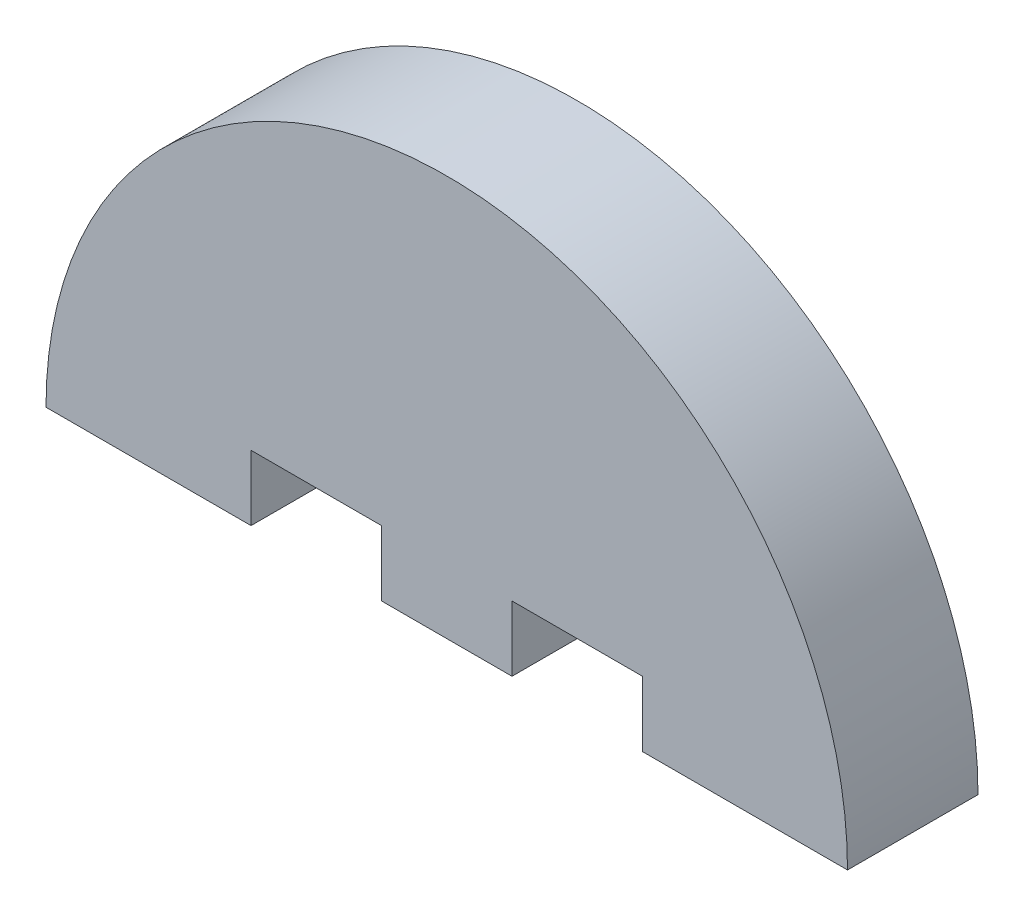
ISO-10303-21;
HEADER;
FILE_DESCRIPTION(('STEP AP214'),'2;1');
FILE_NAME('part.step','',(''),(''),'','','');
FILE_SCHEMA(('AUTOMOTIVE_DESIGN { 1 0 10303 214 1 1 1 1 }'));
ENDSEC;
DATA;
#1=APPLICATION_CONTEXT('core data for automotive mechanical design processes');
#2=APPLICATION_PROTOCOL_DEFINITION('international standard','automotive_design',2000,#1);
#3=PRODUCT_CONTEXT('',#1,'mechanical');
#4=PRODUCT('Part','Part','',(#3));
#5=PRODUCT_RELATED_PRODUCT_CATEGORY('part','',(#4));
#6=PRODUCT_DEFINITION_FORMATION('','',#4);
#7=PRODUCT_DEFINITION_CONTEXT('part definition',#1,'design');
#8=PRODUCT_DEFINITION('design','',#6,#7);
#9=PRODUCT_DEFINITION_SHAPE('','',#8);
#10=(LENGTH_UNIT() NAMED_UNIT(*) SI_UNIT(.MILLI.,.METRE.));
#11=(NAMED_UNIT(*) PLANE_ANGLE_UNIT() SI_UNIT($,.RADIAN.));
#12=(NAMED_UNIT(*) SI_UNIT($,.STERADIAN.) SOLID_ANGLE_UNIT());
#13=UNCERTAINTY_MEASURE_WITH_UNIT(LENGTH_MEASURE(1.E-05),#10,'distance_accuracy_value','');
#14=(GEOMETRIC_REPRESENTATION_CONTEXT(3) GLOBAL_UNCERTAINTY_ASSIGNED_CONTEXT((#13)) GLOBAL_UNIT_ASSIGNED_CONTEXT((#10,
#11,#12)) REPRESENTATION_CONTEXT('',''));
#15=CARTESIAN_POINT('',(0.,0.,0.));
#16=DIRECTION('',(0.,0.,1.));
#17=DIRECTION('',(1.,0.,0.));
#18=AXIS2_PLACEMENT_3D('',#15,#16,#17);
#19=CARTESIAN_POINT('',(3624.68304741668,1289.90302757437,6.));
#20=DIRECTION('',(0.,-1.,0.));
#21=DIRECTION('',(0.,0.,-1.));
#22=AXIS2_PLACEMENT_3D('',#19,#20,#21);
#23=PLANE('',#22);
#24=DIRECTION('',(-1.,0.,0.));
#25=VECTOR('',#24,1.);
#26=CARTESIAN_POINT('',(3624.68304741668,1289.90302757437,0.));
#27=LINE('',#26,#25);
#28=CARTESIAN_POINT('',(3624.68304741668,1289.90302757437,0.));
#29=VERTEX_POINT('',#28);
#30=CARTESIAN_POINT('',(3615.25447598811,1289.90302757437,0.));
#31=VERTEX_POINT('',#30);
#32=EDGE_CURVE('E154',#29,#31,#27,.T.);
#33=ORIENTED_EDGE('',*,*,#32,.F.);
#34=DIRECTION('',(0.,0.,-1.));
#35=VECTOR('',#34,1.);
#36=CARTESIAN_POINT('',(3624.68304741668,1289.90302757437,6.));
#37=LINE('',#36,#35);
#38=CARTESIAN_POINT('',(3624.68304741668,1289.90302757437,6.));
#39=VERTEX_POINT('',#38);
#40=EDGE_CURVE('E11',#39,#29,#37,.T.);
#41=ORIENTED_EDGE('',*,*,#40,.F.);
#42=DIRECTION('',(-1.,0.,0.));
#43=VECTOR('',#42,1.);
#44=CARTESIAN_POINT('',(3624.68304741668,1289.90302757437,6.));
#45=LINE('',#44,#43);
#46=CARTESIAN_POINT('',(3615.25447598811,1289.90302757437,6.));
#47=VERTEX_POINT('',#46);
#48=EDGE_CURVE('E188',#39,#47,#45,.T.);
#49=ORIENTED_EDGE('',*,*,#48,.T.);
#50=DIRECTION('',(0.,0.,-1.));
#51=VECTOR('',#50,1.);
#52=CARTESIAN_POINT('',(3615.25447598811,1289.90302757437,6.));
#53=LINE('',#52,#51);
#54=EDGE_CURVE('E42',#47,#31,#53,.T.);
#55=ORIENTED_EDGE('',*,*,#54,.T.);
#56=EDGE_LOOP('',(#33,#41,#49,#55));
#57=FACE_BOUND('',#56,.T.);
#58=ADVANCED_FACE('F39',(#57),#23,.T.);
#59=CARTESIAN_POINT('',(3606.25447598811,1289.90302757437,6.));
#60=DIRECTION('',(0.,0.,-1.));
#61=DIRECTION('',(-1.,0.,0.));
#62=AXIS2_PLACEMENT_3D('',#59,#60,#61);
#63=CYLINDRICAL_SURFACE('',#62,18.4285714285706);
#64=CARTESIAN_POINT('',(3606.25447598811,1289.90302757437,0.));
#65=DIRECTION('',(0.,0.,1.));
#66=DIRECTION('',(1.,0.,0.));
#67=AXIS2_PLACEMENT_3D('',#64,#65,#66);
#68=CIRCLE('',#67,18.4285714285706);
#69=CARTESIAN_POINT('',(3587.82590455954,1289.90302757437,0.));
#70=VERTEX_POINT('',#69);
#71=EDGE_CURVE('E186',#29,#70,#68,.T.);
#72=ORIENTED_EDGE('',*,*,#71,.T.);
#73=DIRECTION('',(0.,0.,-1.));
#74=VECTOR('',#73,1.);
#75=CARTESIAN_POINT('',(3587.82590455954,1289.90302757437,6.));
#76=LINE('',#75,#74);
#77=CARTESIAN_POINT('',(3587.82590455954,1289.90302757437,6.));
#78=VERTEX_POINT('',#77);
#79=EDGE_CURVE('E49',#78,#70,#76,.T.);
#80=ORIENTED_EDGE('',*,*,#79,.F.);
#81=CARTESIAN_POINT('',(3606.25447598811,1289.90302757437,6.));
#82=DIRECTION('',(0.,0.,1.));
#83=DIRECTION('',(1.,0.,0.));
#84=AXIS2_PLACEMENT_3D('',#81,#82,#83);
#85=CIRCLE('',#84,18.4285714285706);
#86=EDGE_CURVE('E139',#39,#78,#85,.T.);
#87=ORIENTED_EDGE('',*,*,#86,.F.);
#88=ORIENTED_EDGE('',*,*,#40,.T.);
#89=EDGE_LOOP('',(#72,#80,#87,#88));
#90=FACE_BOUND('',#89,.T.);
#91=ADVANCED_FACE('F215',(#90),#63,.T.);
#92=CARTESIAN_POINT('',(3597.25447598811,1289.90302757437,6.));
#93=DIRECTION('',(0.,-1.,0.));
#94=DIRECTION('',(0.,0.,-1.));
#95=AXIS2_PLACEMENT_3D('',#92,#93,#94);
#96=PLANE('',#95);
#97=DIRECTION('',(-1.,0.,0.));
#98=VECTOR('',#97,1.);
#99=CARTESIAN_POINT('',(3597.25447598811,1289.90302757437,0.));
#100=LINE('',#99,#98);
#101=CARTESIAN_POINT('',(3597.25447598811,1289.90302757437,0.));
#102=VERTEX_POINT('',#101);
#103=EDGE_CURVE('E128',#102,#70,#100,.T.);
#104=ORIENTED_EDGE('',*,*,#103,.F.);
#105=DIRECTION('',(0.,0.,-1.));
#106=VECTOR('',#105,1.);
#107=CARTESIAN_POINT('',(3597.25447598811,1289.90302757437,6.));
#108=LINE('',#107,#106);
#109=CARTESIAN_POINT('',(3597.25447598811,1289.90302757437,6.));
#110=VERTEX_POINT('',#109);
#111=EDGE_CURVE('E123',#110,#102,#108,.T.);
#112=ORIENTED_EDGE('',*,*,#111,.F.);
#113=DIRECTION('',(-1.,0.,0.));
#114=VECTOR('',#113,1.);
#115=CARTESIAN_POINT('',(3597.25447598811,1289.90302757437,6.));
#116=LINE('',#115,#114);
#117=EDGE_CURVE('E126',#110,#78,#116,.T.);
#118=ORIENTED_EDGE('',*,*,#117,.T.);
#119=ORIENTED_EDGE('',*,*,#79,.T.);
#120=EDGE_LOOP('',(#104,#112,#118,#119));
#121=FACE_BOUND('',#120,.T.);
#122=ADVANCED_FACE('F125',(#121),#96,.T.);
#123=CARTESIAN_POINT('',(3597.25447598811,1292.90302757437,6.));
#124=DIRECTION('',(1.,0.,0.));
#125=DIRECTION('',(0.,0.,-1.));
#126=AXIS2_PLACEMENT_3D('',#123,#124,#125);
#127=PLANE('',#126);
#128=DIRECTION('',(0.,-1.,0.));
#129=VECTOR('',#128,1.);
#130=CARTESIAN_POINT('',(3597.25447598811,1292.90302757437,0.));
#131=LINE('',#130,#129);
#132=CARTESIAN_POINT('',(3597.25447598811,1292.90302757437,0.));
#133=VERTEX_POINT('',#132);
#134=EDGE_CURVE('E181',#133,#102,#131,.T.);
#135=ORIENTED_EDGE('',*,*,#134,.F.);
#136=DIRECTION('',(0.,0.,-1.));
#137=VECTOR('',#136,1.);
#138=CARTESIAN_POINT('',(3597.25447598811,1292.90302757437,6.));
#139=LINE('',#138,#137);
#140=CARTESIAN_POINT('',(3597.25447598811,1292.90302757437,6.));
#141=VERTEX_POINT('',#140);
#142=EDGE_CURVE('E134',#141,#133,#139,.T.);
#143=ORIENTED_EDGE('',*,*,#142,.F.);
#144=DIRECTION('',(0.,-1.,0.));
#145=VECTOR('',#144,1.);
#146=CARTESIAN_POINT('',(3597.25447598811,1292.90302757437,6.));
#147=LINE('',#146,#145);
#148=EDGE_CURVE('E138',#141,#110,#147,.T.);
#149=ORIENTED_EDGE('',*,*,#148,.T.);
#150=ORIENTED_EDGE('',*,*,#111,.T.);
#151=EDGE_LOOP('',(#135,#143,#149,#150));
#152=FACE_BOUND('',#151,.T.);
#153=ADVANCED_FACE('F142',(#152),#127,.T.);
#154=CARTESIAN_POINT('',(3597.25447598811,1292.90302757437,6.));
#155=DIRECTION('',(0.,1.,0.));
#156=DIRECTION('',(0.,0.,1.));
#157=AXIS2_PLACEMENT_3D('',#154,#155,#156);
#158=PLANE('',#157);
#159=DIRECTION('',(1.,0.,0.));
#160=VECTOR('',#159,1.);
#161=CARTESIAN_POINT('',(3597.25447598811,1292.90302757437,0.));
#162=LINE('',#161,#160);
#163=CARTESIAN_POINT('',(3603.25447598811,1292.90302757437,0.));
#164=VERTEX_POINT('',#163);
#165=EDGE_CURVE('E178',#133,#164,#162,.T.);
#166=ORIENTED_EDGE('',*,*,#165,.T.);
#167=DIRECTION('',(0.,0.,-1.));
#168=VECTOR('',#167,1.);
#169=CARTESIAN_POINT('',(3603.25447598811,1292.90302757437,6.));
#170=LINE('',#169,#168);
#171=CARTESIAN_POINT('',(3603.25447598811,1292.90302757437,6.));
#172=VERTEX_POINT('',#171);
#173=EDGE_CURVE('E194',#172,#164,#170,.T.);
#174=ORIENTED_EDGE('',*,*,#173,.F.);
#175=DIRECTION('',(1.,0.,0.));
#176=VECTOR('',#175,1.);
#177=CARTESIAN_POINT('',(3597.25447598811,1292.90302757437,6.));
#178=LINE('',#177,#176);
#179=EDGE_CURVE('E145',#141,#172,#178,.T.);
#180=ORIENTED_EDGE('',*,*,#179,.F.);
#181=ORIENTED_EDGE('',*,*,#142,.T.);
#182=EDGE_LOOP('',(#166,#174,#180,#181));
#183=FACE_BOUND('',#182,.T.);
#184=ADVANCED_FACE('F251',(#183),#158,.F.);
#185=CARTESIAN_POINT('',(3603.25447598811,1292.90302757437,6.));
#186=DIRECTION('',(1.,0.,0.));
#187=DIRECTION('',(0.,0.,-1.));
#188=AXIS2_PLACEMENT_3D('',#185,#186,#187);
#189=PLANE('',#188);
#190=DIRECTION('',(0.,-1.,0.));
#191=VECTOR('',#190,1.);
#192=CARTESIAN_POINT('',(3603.25447598811,1292.90302757437,0.));
#193=LINE('',#192,#191);
#194=CARTESIAN_POINT('',(3603.25447598811,1289.90302757437,0.));
#195=VERTEX_POINT('',#194);
#196=EDGE_CURVE('E174',#164,#195,#193,.T.);
#197=ORIENTED_EDGE('',*,*,#196,.T.);
#198=DIRECTION('',(0.,0.,-1.));
#199=VECTOR('',#198,1.);
#200=CARTESIAN_POINT('',(3603.25447598811,1289.90302757437,6.));
#201=LINE('',#200,#199);
#202=CARTESIAN_POINT('',(3603.25447598811,1289.90302757437,6.));
#203=VERTEX_POINT('',#202);
#204=EDGE_CURVE('E198',#203,#195,#201,.T.);
#205=ORIENTED_EDGE('',*,*,#204,.F.);
#206=DIRECTION('',(0.,-1.,0.));
#207=VECTOR('',#206,1.);
#208=CARTESIAN_POINT('',(3603.25447598811,1292.90302757437,6.));
#209=LINE('',#208,#207);
#210=EDGE_CURVE('E148',#172,#203,#209,.T.);
#211=ORIENTED_EDGE('',*,*,#210,.F.);
#212=ORIENTED_EDGE('',*,*,#173,.T.);
#213=EDGE_LOOP('',(#197,#205,#211,#212));
#214=FACE_BOUND('',#213,.T.);
#215=ADVANCED_FACE('F239',(#214),#189,.F.);
#216=CARTESIAN_POINT('',(3609.25447598811,1289.90302757437,6.));
#217=DIRECTION('',(0.,-1.,0.));
#218=DIRECTION('',(0.,0.,-1.));
#219=AXIS2_PLACEMENT_3D('',#216,#217,#218);
#220=PLANE('',#219);
#221=DIRECTION('',(-1.,0.,0.));
#222=VECTOR('',#221,1.);
#223=CARTESIAN_POINT('',(3609.25447598811,1289.90302757437,0.));
#224=LINE('',#223,#222);
#225=CARTESIAN_POINT('',(3609.25447598811,1289.90302757437,0.));
#226=VERTEX_POINT('',#225);
#227=EDGE_CURVE('E170',#226,#195,#224,.T.);
#228=ORIENTED_EDGE('',*,*,#227,.F.);
#229=DIRECTION('',(0.,0.,-1.));
#230=VECTOR('',#229,1.);
#231=CARTESIAN_POINT('',(3609.25447598811,1289.90302757437,6.));
#232=LINE('',#231,#230);
#233=CARTESIAN_POINT('',(3609.25447598811,1289.90302757437,6.));
#234=VERTEX_POINT('',#233);
#235=EDGE_CURVE('E201',#234,#226,#232,.T.);
#236=ORIENTED_EDGE('',*,*,#235,.F.);
#237=DIRECTION('',(-1.,0.,0.));
#238=VECTOR('',#237,1.);
#239=CARTESIAN_POINT('',(3609.25447598811,1289.90302757437,6.));
#240=LINE('',#239,#238);
#241=EDGE_CURVE('E229',#234,#203,#240,.T.);
#242=ORIENTED_EDGE('',*,*,#241,.T.);
#243=ORIENTED_EDGE('',*,*,#204,.T.);
#244=EDGE_LOOP('',(#228,#236,#242,#243));
#245=FACE_BOUND('',#244,.T.);
#246=ADVANCED_FACE('F243',(#245),#220,.T.);
#247=CARTESIAN_POINT('',(3609.25447598811,1292.90302757437,6.));
#248=DIRECTION('',(1.,0.,0.));
#249=DIRECTION('',(0.,0.,-1.));
#250=AXIS2_PLACEMENT_3D('',#247,#248,#249);
#251=PLANE('',#250);
#252=DIRECTION('',(0.,-1.,0.));
#253=VECTOR('',#252,1.);
#254=CARTESIAN_POINT('',(3609.25447598811,1292.90302757437,0.));
#255=LINE('',#254,#253);
#256=CARTESIAN_POINT('',(3609.25447598811,1292.90302757437,0.));
#257=VERTEX_POINT('',#256);
#258=EDGE_CURVE('E166',#257,#226,#255,.T.);
#259=ORIENTED_EDGE('',*,*,#258,.F.);
#260=DIRECTION('',(0.,0.,-1.));
#261=VECTOR('',#260,1.);
#262=CARTESIAN_POINT('',(3609.25447598811,1292.90302757437,6.));
#263=LINE('',#262,#261);
#264=CARTESIAN_POINT('',(3609.25447598811,1292.90302757437,6.));
#265=VERTEX_POINT('',#264);
#266=EDGE_CURVE('E204',#265,#257,#263,.T.);
#267=ORIENTED_EDGE('',*,*,#266,.F.);
#268=DIRECTION('',(0.,-1.,0.));
#269=VECTOR('',#268,1.);
#270=CARTESIAN_POINT('',(3609.25447598811,1292.90302757437,6.));
#271=LINE('',#270,#269);
#272=EDGE_CURVE('E225',#265,#234,#271,.T.);
#273=ORIENTED_EDGE('',*,*,#272,.T.);
#274=ORIENTED_EDGE('',*,*,#235,.T.);
#275=EDGE_LOOP('',(#259,#267,#273,#274));
#276=FACE_BOUND('',#275,.T.);
#277=ADVANCED_FACE('F246',(#276),#251,.T.);
#278=CARTESIAN_POINT('',(3615.25447598811,1292.90302757437,6.));
#279=DIRECTION('',(0.,-1.,0.));
#280=DIRECTION('',(0.,0.,-1.));
#281=AXIS2_PLACEMENT_3D('',#278,#279,#280);
#282=PLANE('',#281);
#283=DIRECTION('',(-1.,0.,0.));
#284=VECTOR('',#283,1.);
#285=CARTESIAN_POINT('',(3615.25447598811,1292.90302757437,0.));
#286=LINE('',#285,#284);
#287=CARTESIAN_POINT('',(3615.25447598811,1292.90302757437,0.));
#288=VERTEX_POINT('',#287);
#289=EDGE_CURVE('E162',#288,#257,#286,.T.);
#290=ORIENTED_EDGE('',*,*,#289,.F.);
#291=DIRECTION('',(0.,0.,-1.));
#292=VECTOR('',#291,1.);
#293=CARTESIAN_POINT('',(3615.25447598811,1292.90302757437,6.));
#294=LINE('',#293,#292);
#295=CARTESIAN_POINT('',(3615.25447598811,1292.90302757437,6.));
#296=VERTEX_POINT('',#295);
#297=EDGE_CURVE('E206',#296,#288,#294,.T.);
#298=ORIENTED_EDGE('',*,*,#297,.F.);
#299=DIRECTION('',(-1.,0.,0.));
#300=VECTOR('',#299,1.);
#301=CARTESIAN_POINT('',(3615.25447598811,1292.90302757437,6.));
#302=LINE('',#301,#300);
#303=EDGE_CURVE('E219',#296,#265,#302,.T.);
#304=ORIENTED_EDGE('',*,*,#303,.T.);
#305=ORIENTED_EDGE('',*,*,#266,.T.);
#306=EDGE_LOOP('',(#290,#298,#304,#305));
#307=FACE_BOUND('',#306,.T.);
#308=ADVANCED_FACE('F248',(#307),#282,.T.);
#309=CARTESIAN_POINT('',(3615.25447598811,1292.90302757437,6.));
#310=DIRECTION('',(1.,0.,0.));
#311=DIRECTION('',(0.,0.,-1.));
#312=AXIS2_PLACEMENT_3D('',#309,#310,#311);
#313=PLANE('',#312);
#314=DIRECTION('',(0.,-1.,0.));
#315=VECTOR('',#314,1.);
#316=CARTESIAN_POINT('',(3615.25447598811,1292.90302757437,0.));
#317=LINE('',#316,#315);
#318=EDGE_CURVE('E158',#288,#31,#317,.T.);
#319=ORIENTED_EDGE('',*,*,#318,.T.);
#320=ORIENTED_EDGE('',*,*,#54,.F.);
#321=DIRECTION('',(0.,-1.,0.));
#322=VECTOR('',#321,1.);
#323=CARTESIAN_POINT('',(3615.25447598811,1292.90302757437,6.));
#324=LINE('',#323,#322);
#325=EDGE_CURVE('E103',#296,#47,#324,.T.);
#326=ORIENTED_EDGE('',*,*,#325,.F.);
#327=ORIENTED_EDGE('',*,*,#297,.T.);
#328=EDGE_LOOP('',(#319,#320,#326,#327));
#329=FACE_BOUND('',#328,.T.);
#330=ADVANCED_FACE('F211',(#329),#313,.F.);
#331=CARTESIAN_POINT('',(3606.25447598811,1289.90302757437,6.));
#332=DIRECTION('',(0.,0.,1.));
#333=DIRECTION('',(1.,0.,0.));
#334=AXIS2_PLACEMENT_3D('',#331,#332,#333);
#335=PLANE('',#334);
#336=ORIENTED_EDGE('',*,*,#48,.F.);
#337=ORIENTED_EDGE('',*,*,#86,.T.);
#338=ORIENTED_EDGE('',*,*,#117,.F.);
#339=ORIENTED_EDGE('',*,*,#148,.F.);
#340=ORIENTED_EDGE('',*,*,#179,.T.);
#341=ORIENTED_EDGE('',*,*,#210,.T.);
#342=ORIENTED_EDGE('',*,*,#241,.F.);
#343=ORIENTED_EDGE('',*,*,#272,.F.);
#344=ORIENTED_EDGE('',*,*,#303,.F.);
#345=ORIENTED_EDGE('',*,*,#325,.T.);
#346=EDGE_LOOP('',(#336,#337,#338,#339,#340,#341,#342,#343,#344,#345));
#347=FACE_BOUND('',#346,.T.);
#348=ADVANCED_FACE('F137',(#347),#335,.T.);
#349=CARTESIAN_POINT('',(3606.25447598811,1289.90302757437,0.));
#350=DIRECTION('',(0.,0.,1.));
#351=DIRECTION('',(1.,0.,0.));
#352=AXIS2_PLACEMENT_3D('',#349,#350,#351);
#353=PLANE('',#352);
#354=ORIENTED_EDGE('',*,*,#32,.T.);
#355=ORIENTED_EDGE('',*,*,#318,.F.);
#356=ORIENTED_EDGE('',*,*,#289,.T.);
#357=ORIENTED_EDGE('',*,*,#258,.T.);
#358=ORIENTED_EDGE('',*,*,#227,.T.);
#359=ORIENTED_EDGE('',*,*,#196,.F.);
#360=ORIENTED_EDGE('',*,*,#165,.F.);
#361=ORIENTED_EDGE('',*,*,#134,.T.);
#362=ORIENTED_EDGE('',*,*,#103,.T.);
#363=ORIENTED_EDGE('',*,*,#71,.F.);
#364=EDGE_LOOP('',(#354,#355,#356,#357,#358,#359,#360,#361,#362,#363));
#365=FACE_BOUND('',#364,.T.);
#366=ADVANCED_FACE('F214',(#365),#353,.F.);
#367=CLOSED_SHELL('',(#58,#91,#122,#153,#184,#215,#246,#277,#308,#330,#348,#366));
#368=MANIFOLD_SOLID_BREP('B2',#367);
#369=ADVANCED_BREP_SHAPE_REPRESENTATION('',(#18,#368),#14);
#370=SHAPE_DEFINITION_REPRESENTATION(#9,#369);
ENDSEC;
END-ISO-10303-21;
